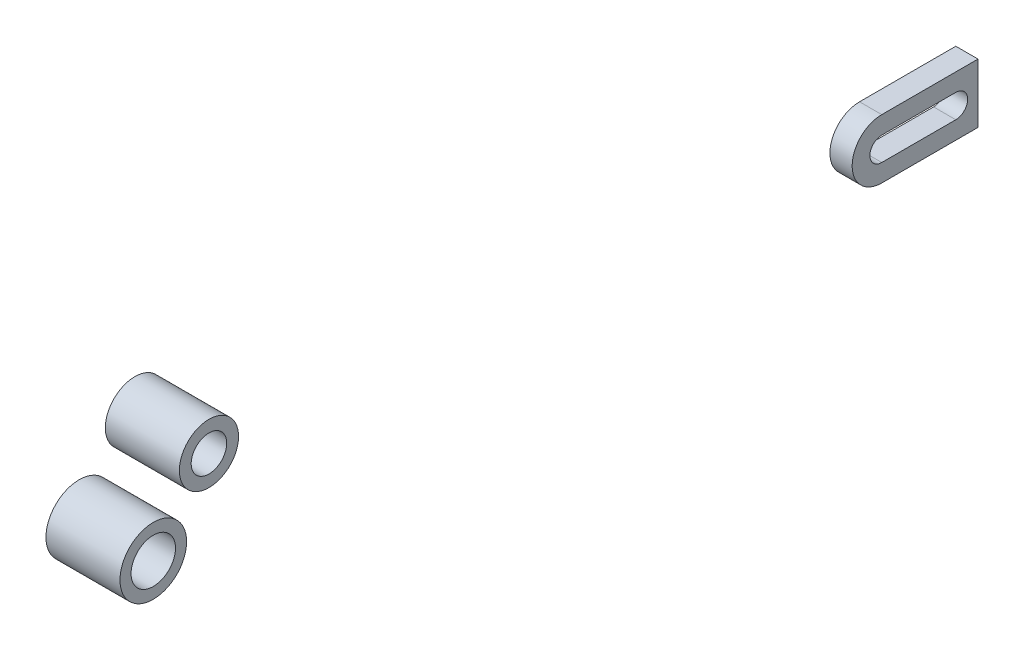
ISO-10303-21;
HEADER;
FILE_DESCRIPTION(('STEP AP214'),'2;1');
FILE_NAME('part.step','',(''),(''),'','','');
FILE_SCHEMA(('AUTOMOTIVE_DESIGN { 1 0 10303 214 1 1 1 1 }'));
ENDSEC;
DATA;
#1=APPLICATION_CONTEXT('core data for automotive mechanical design processes');
#2=APPLICATION_PROTOCOL_DEFINITION('international standard','automotive_design',2000,#1);
#3=PRODUCT_CONTEXT('',#1,'mechanical');
#4=PRODUCT('Part','Part','',(#3));
#5=PRODUCT_RELATED_PRODUCT_CATEGORY('part','',(#4));
#6=PRODUCT_DEFINITION_FORMATION('','',#4);
#7=PRODUCT_DEFINITION_CONTEXT('part definition',#1,'design');
#8=PRODUCT_DEFINITION('design','',#6,#7);
#9=PRODUCT_DEFINITION_SHAPE('','',#8);
#10=(LENGTH_UNIT() NAMED_UNIT(*) SI_UNIT(.MILLI.,.METRE.));
#11=(NAMED_UNIT(*) PLANE_ANGLE_UNIT() SI_UNIT($,.RADIAN.));
#12=(NAMED_UNIT(*) SI_UNIT($,.STERADIAN.) SOLID_ANGLE_UNIT());
#13=UNCERTAINTY_MEASURE_WITH_UNIT(LENGTH_MEASURE(1.E-05),#10,'distance_accuracy_value','');
#14=(GEOMETRIC_REPRESENTATION_CONTEXT(3) GLOBAL_UNCERTAINTY_ASSIGNED_CONTEXT((#13)) GLOBAL_UNIT_ASSIGNED_CONTEXT((#10,
#11,#12)) REPRESENTATION_CONTEXT('',''));
#15=CARTESIAN_POINT('',(0.,0.,0.));
#16=DIRECTION('',(0.,0.,1.));
#17=DIRECTION('',(1.,0.,0.));
#18=AXIS2_PLACEMENT_3D('',#15,#16,#17);
#19=CARTESIAN_POINT('',(139.999999999998,0.,-487.));
#20=DIRECTION('',(1.,0.,0.));
#21=DIRECTION('',(0.,0.,-1.));
#22=AXIS2_PLACEMENT_3D('',#19,#20,#21);
#23=PLANE('',#22);
#24=CARTESIAN_POINT('',(139.999999999998,0.,-487.));
#25=DIRECTION('',(1.,0.,0.));
#26=DIRECTION('',(0.,0.,-1.));
#27=AXIS2_PLACEMENT_3D('',#24,#25,#26);
#28=CIRCLE('',#27,20.0000000000001);
#29=CARTESIAN_POINT('',(139.999999999998,20.0000000000001,-487.));
#30=VERTEX_POINT('',#29);
#31=CARTESIAN_POINT('',(139.999999999998,-20.0000000000001,-487.));
#32=VERTEX_POINT('',#31);
#33=EDGE_CURVE('E146',#30,#32,#28,.T.);
#34=ORIENTED_EDGE('',*,*,#33,.T.);
#35=DIRECTION('',(0.,0.,-1.));
#36=VECTOR('',#35,1.);
#37=CARTESIAN_POINT('',(139.999999999998,-20.0000000000001,-487.));
#38=LINE('',#37,#36);
#39=CARTESIAN_POINT('',(139.999999999998,-20.0000000000001,-552.));
#40=VERTEX_POINT('',#39);
#41=EDGE_CURVE('E149',#32,#40,#38,.T.);
#42=ORIENTED_EDGE('',*,*,#41,.T.);
#43=DIRECTION('',(0.,1.,0.));
#44=VECTOR('',#43,1.);
#45=CARTESIAN_POINT('',(139.999999999998,-20.0000000000001,-552.));
#46=LINE('',#45,#44);
#47=CARTESIAN_POINT('',(139.999999999998,20.,-552.));
#48=VERTEX_POINT('',#47);
#49=EDGE_CURVE('E152',#40,#48,#46,.T.);
#50=ORIENTED_EDGE('',*,*,#49,.T.);
#51=DIRECTION('',(0.,0.,1.));
#52=VECTOR('',#51,1.);
#53=CARTESIAN_POINT('',(139.999999999998,20.0000000000001,-487.));
#54=LINE('',#53,#52);
#55=EDGE_CURVE('E154',#48,#30,#54,.T.);
#56=ORIENTED_EDGE('',*,*,#55,.T.);
#57=EDGE_LOOP('',(#34,#42,#50,#56));
#58=FACE_BOUND('',#57,.T.);
#59=DIRECTION('',(0.,0.,1.));
#60=VECTOR('',#59,1.);
#61=CARTESIAN_POINT('',(139.999999999998,7.99999999999998,-537.));
#62=LINE('',#61,#60);
#63=CARTESIAN_POINT('',(139.999999999998,7.99999999999998,-537.));
#64=VERTEX_POINT('',#63);
#65=CARTESIAN_POINT('',(139.999999999998,7.99999999999998,-487.));
#66=VERTEX_POINT('',#65);
#67=EDGE_CURVE('E118',#64,#66,#62,.T.);
#68=ORIENTED_EDGE('',*,*,#67,.F.);
#69=CARTESIAN_POINT('',(139.999999999998,0.,-537.));
#70=DIRECTION('',(1.,0.,0.));
#71=DIRECTION('',(0.,0.,-1.));
#72=AXIS2_PLACEMENT_3D('',#69,#70,#71);
#73=CIRCLE('',#72,7.99999999999998);
#74=CARTESIAN_POINT('',(139.999999999998,-7.99999999999998,-537.));
#75=VERTEX_POINT('',#74);
#76=EDGE_CURVE('E110',#75,#64,#73,.T.);
#77=ORIENTED_EDGE('',*,*,#76,.F.);
#78=DIRECTION('',(0.,0.,-1.));
#79=VECTOR('',#78,1.);
#80=CARTESIAN_POINT('',(139.999999999998,-7.99999999999998,-537.));
#81=LINE('',#80,#79);
#82=CARTESIAN_POINT('',(139.999999999998,-7.99999999999998,-487.));
#83=VERTEX_POINT('',#82);
#84=EDGE_CURVE('E132',#83,#75,#81,.T.);
#85=ORIENTED_EDGE('',*,*,#84,.F.);
#86=CARTESIAN_POINT('',(139.999999999998,0.,-487.));
#87=DIRECTION('',(1.,0.,0.));
#88=DIRECTION('',(0.,0.,-1.));
#89=AXIS2_PLACEMENT_3D('',#86,#87,#88);
#90=CIRCLE('',#89,7.99999999999998);
#91=EDGE_CURVE('E130',#66,#83,#90,.T.);
#92=ORIENTED_EDGE('',*,*,#91,.F.);
#93=EDGE_LOOP('',(#68,#77,#85,#92));
#94=FACE_BOUND('',#93,.T.);
#95=ADVANCED_FACE('F45',(#58,#94),#23,.T.);
#96=CARTESIAN_POINT('',(124.999999999998,0.,-487.));
#97=DIRECTION('',(1.,0.,0.));
#98=DIRECTION('',(0.,0.,-1.));
#99=AXIS2_PLACEMENT_3D('',#96,#97,#98);
#100=PLANE('',#99);
#101=CARTESIAN_POINT('',(124.999999999998,0.,-487.));
#102=DIRECTION('',(1.,0.,0.));
#103=DIRECTION('',(0.,0.,-1.));
#104=AXIS2_PLACEMENT_3D('',#101,#102,#103);
#105=CIRCLE('',#104,20.0000000000001);
#106=CARTESIAN_POINT('',(124.999999999998,20.0000000000001,-487.));
#107=VERTEX_POINT('',#106);
#108=CARTESIAN_POINT('',(124.999999999998,-20.0000000000001,-487.));
#109=VERTEX_POINT('',#108);
#110=EDGE_CURVE('E126',#107,#109,#105,.T.);
#111=ORIENTED_EDGE('',*,*,#110,.F.);
#112=DIRECTION('',(0.,0.,1.));
#113=VECTOR('',#112,1.);
#114=CARTESIAN_POINT('',(124.999999999998,20.0000000000001,-487.));
#115=LINE('',#114,#113);
#116=CARTESIAN_POINT('',(124.999999999998,20.,-552.));
#117=VERTEX_POINT('',#116);
#118=EDGE_CURVE('E150',#117,#107,#115,.T.);
#119=ORIENTED_EDGE('',*,*,#118,.F.);
#120=DIRECTION('',(0.,1.,0.));
#121=VECTOR('',#120,1.);
#122=CARTESIAN_POINT('',(124.999999999998,-20.0000000000001,-552.));
#123=LINE('',#122,#121);
#124=CARTESIAN_POINT('',(124.999999999998,-20.0000000000001,-552.));
#125=VERTEX_POINT('',#124);
#126=EDGE_CURVE('E161',#125,#117,#123,.T.);
#127=ORIENTED_EDGE('',*,*,#126,.F.);
#128=DIRECTION('',(0.,0.,-1.));
#129=VECTOR('',#128,1.);
#130=CARTESIAN_POINT('',(124.999999999998,-20.0000000000001,-487.));
#131=LINE('',#130,#129);
#132=EDGE_CURVE('E159',#109,#125,#131,.T.);
#133=ORIENTED_EDGE('',*,*,#132,.F.);
#134=EDGE_LOOP('',(#111,#119,#127,#133));
#135=FACE_BOUND('',#134,.T.);
#136=CARTESIAN_POINT('',(124.999999999998,0.,-537.));
#137=DIRECTION('',(1.,0.,0.));
#138=DIRECTION('',(0.,0.,-1.));
#139=AXIS2_PLACEMENT_3D('',#136,#137,#138);
#140=CIRCLE('',#139,7.99999999999998);
#141=CARTESIAN_POINT('',(124.999999999998,-7.99999999999998,-537.));
#142=VERTEX_POINT('',#141);
#143=CARTESIAN_POINT('',(124.999999999998,7.99999999999998,-537.));
#144=VERTEX_POINT('',#143);
#145=EDGE_CURVE('E68',#142,#144,#140,.T.);
#146=ORIENTED_EDGE('',*,*,#145,.T.);
#147=DIRECTION('',(0.,0.,1.));
#148=VECTOR('',#147,1.);
#149=CARTESIAN_POINT('',(124.999999999998,7.99999999999998,-537.));
#150=LINE('',#149,#148);
#151=CARTESIAN_POINT('',(124.999999999998,7.99999999999998,-487.));
#152=VERTEX_POINT('',#151);
#153=EDGE_CURVE('E125',#144,#152,#150,.T.);
#154=ORIENTED_EDGE('',*,*,#153,.T.);
#155=CARTESIAN_POINT('',(124.999999999998,0.,-487.));
#156=DIRECTION('',(1.,0.,0.));
#157=DIRECTION('',(0.,0.,-1.));
#158=AXIS2_PLACEMENT_3D('',#155,#156,#157);
#159=CIRCLE('',#158,7.99999999999998);
#160=CARTESIAN_POINT('',(124.999999999998,-7.99999999999998,-487.));
#161=VERTEX_POINT('',#160);
#162=EDGE_CURVE('E138',#152,#161,#159,.T.);
#163=ORIENTED_EDGE('',*,*,#162,.T.);
#164=DIRECTION('',(0.,0.,-1.));
#165=VECTOR('',#164,1.);
#166=CARTESIAN_POINT('',(124.999999999998,-7.99999999999998,-537.));
#167=LINE('',#166,#165);
#168=EDGE_CURVE('E119',#161,#142,#167,.T.);
#169=ORIENTED_EDGE('',*,*,#168,.T.);
#170=EDGE_LOOP('',(#146,#154,#163,#169));
#171=FACE_BOUND('',#170,.T.);
#172=ADVANCED_FACE('F179',(#135,#171),#100,.F.);
#173=CARTESIAN_POINT('',(139.999999999998,0.,-487.));
#174=DIRECTION('',(-1.,0.,0.));
#175=DIRECTION('',(0.,0.,1.));
#176=AXIS2_PLACEMENT_3D('',#173,#174,#175);
#177=CYLINDRICAL_SURFACE('',#176,20.0000000000001);
#178=ORIENTED_EDGE('',*,*,#110,.T.);
#179=DIRECTION('',(-1.,0.,0.));
#180=VECTOR('',#179,1.);
#181=CARTESIAN_POINT('',(139.999999999998,-20.0000000000001,-487.));
#182=LINE('',#181,#180);
#183=EDGE_CURVE('E12',#32,#109,#182,.T.);
#184=ORIENTED_EDGE('',*,*,#183,.F.);
#185=ORIENTED_EDGE('',*,*,#33,.F.);
#186=DIRECTION('',(-1.,0.,0.));
#187=VECTOR('',#186,1.);
#188=CARTESIAN_POINT('',(139.999999999998,20.0000000000001,-487.));
#189=LINE('',#188,#187);
#190=EDGE_CURVE('E156',#30,#107,#189,.T.);
#191=ORIENTED_EDGE('',*,*,#190,.T.);
#192=EDGE_LOOP('',(#178,#184,#185,#191));
#193=FACE_BOUND('',#192,.T.);
#194=ADVANCED_FACE('F47',(#193),#177,.T.);
#195=CARTESIAN_POINT('',(139.999999999998,-20.0000000000001,-487.));
#196=DIRECTION('',(0.,1.,0.));
#197=DIRECTION('',(0.,0.,1.));
#198=AXIS2_PLACEMENT_3D('',#195,#196,#197);
#199=PLANE('',#198);
#200=ORIENTED_EDGE('',*,*,#132,.T.);
#201=DIRECTION('',(-1.,0.,0.));
#202=VECTOR('',#201,1.);
#203=CARTESIAN_POINT('',(139.999999999998,-20.0000000000001,-552.));
#204=LINE('',#203,#202);
#205=EDGE_CURVE('E53',#40,#125,#204,.T.);
#206=ORIENTED_EDGE('',*,*,#205,.F.);
#207=ORIENTED_EDGE('',*,*,#41,.F.);
#208=ORIENTED_EDGE('',*,*,#183,.T.);
#209=EDGE_LOOP('',(#200,#206,#207,#208));
#210=FACE_BOUND('',#209,.T.);
#211=ADVANCED_FACE('F189',(#210),#199,.F.);
#212=CARTESIAN_POINT('',(139.999999999998,-20.0000000000001,-552.));
#213=DIRECTION('',(0.,0.,1.));
#214=DIRECTION('',(1.,0.,0.));
#215=AXIS2_PLACEMENT_3D('',#212,#213,#214);
#216=PLANE('',#215);
#217=ORIENTED_EDGE('',*,*,#126,.T.);
#218=DIRECTION('',(-1.,0.,0.));
#219=VECTOR('',#218,1.);
#220=CARTESIAN_POINT('',(139.999999999998,20.,-552.));
#221=LINE('',#220,#219);
#222=EDGE_CURVE('E166',#48,#117,#221,.T.);
#223=ORIENTED_EDGE('',*,*,#222,.F.);
#224=ORIENTED_EDGE('',*,*,#49,.F.);
#225=ORIENTED_EDGE('',*,*,#205,.T.);
#226=EDGE_LOOP('',(#217,#223,#224,#225));
#227=FACE_BOUND('',#226,.T.);
#228=ADVANCED_FACE('F173',(#227),#216,.F.);
#229=CARTESIAN_POINT('',(139.999999999998,20.0000000000001,-487.));
#230=DIRECTION('',(0.,-1.,0.));
#231=DIRECTION('',(0.,0.,-1.));
#232=AXIS2_PLACEMENT_3D('',#229,#230,#231);
#233=PLANE('',#232);
#234=ORIENTED_EDGE('',*,*,#118,.T.);
#235=ORIENTED_EDGE('',*,*,#190,.F.);
#236=ORIENTED_EDGE('',*,*,#55,.F.);
#237=ORIENTED_EDGE('',*,*,#222,.T.);
#238=EDGE_LOOP('',(#234,#235,#236,#237));
#239=FACE_BOUND('',#238,.T.);
#240=ADVANCED_FACE('F183',(#239),#233,.F.);
#241=CARTESIAN_POINT('',(139.999999999998,0.,-537.));
#242=DIRECTION('',(-1.,0.,0.));
#243=DIRECTION('',(0.,0.,1.));
#244=AXIS2_PLACEMENT_3D('',#241,#242,#243);
#245=CYLINDRICAL_SURFACE('',#244,7.99999999999998);
#246=ORIENTED_EDGE('',*,*,#145,.F.);
#247=DIRECTION('',(-1.,0.,0.));
#248=VECTOR('',#247,1.);
#249=CARTESIAN_POINT('',(139.999999999998,-7.99999999999998,-537.));
#250=LINE('',#249,#248);
#251=EDGE_CURVE('E114',#75,#142,#250,.T.);
#252=ORIENTED_EDGE('',*,*,#251,.F.);
#253=ORIENTED_EDGE('',*,*,#76,.T.);
#254=DIRECTION('',(-1.,0.,0.));
#255=VECTOR('',#254,1.);
#256=CARTESIAN_POINT('',(139.999999999998,7.99999999999998,-537.));
#257=LINE('',#256,#255);
#258=EDGE_CURVE('E113',#64,#144,#257,.T.);
#259=ORIENTED_EDGE('',*,*,#258,.T.);
#260=EDGE_LOOP('',(#246,#252,#253,#259));
#261=FACE_BOUND('',#260,.T.);
#262=ADVANCED_FACE('F112',(#261),#245,.F.);
#263=CARTESIAN_POINT('',(139.999999999998,7.99999999999998,-537.));
#264=DIRECTION('',(0.,-1.,0.));
#265=DIRECTION('',(0.,0.,-1.));
#266=AXIS2_PLACEMENT_3D('',#263,#264,#265);
#267=PLANE('',#266);
#268=ORIENTED_EDGE('',*,*,#153,.F.);
#269=ORIENTED_EDGE('',*,*,#258,.F.);
#270=ORIENTED_EDGE('',*,*,#67,.T.);
#271=DIRECTION('',(-1.,0.,0.));
#272=VECTOR('',#271,1.);
#273=CARTESIAN_POINT('',(139.999999999998,7.99999999999998,-487.));
#274=LINE('',#273,#272);
#275=EDGE_CURVE('E127',#66,#152,#274,.T.);
#276=ORIENTED_EDGE('',*,*,#275,.T.);
#277=EDGE_LOOP('',(#268,#269,#270,#276));
#278=FACE_BOUND('',#277,.T.);
#279=ADVANCED_FACE('F122',(#278),#267,.T.);
#280=CARTESIAN_POINT('',(139.999999999998,0.,-487.));
#281=DIRECTION('',(-1.,0.,0.));
#282=DIRECTION('',(0.,0.,1.));
#283=AXIS2_PLACEMENT_3D('',#280,#281,#282);
#284=CYLINDRICAL_SURFACE('',#283,7.99999999999998);
#285=ORIENTED_EDGE('',*,*,#162,.F.);
#286=ORIENTED_EDGE('',*,*,#275,.F.);
#287=ORIENTED_EDGE('',*,*,#91,.T.);
#288=DIRECTION('',(-1.,0.,0.));
#289=VECTOR('',#288,1.);
#290=CARTESIAN_POINT('',(139.999999999998,-7.99999999999998,-487.));
#291=LINE('',#290,#289);
#292=EDGE_CURVE('E60',#83,#161,#291,.T.);
#293=ORIENTED_EDGE('',*,*,#292,.T.);
#294=EDGE_LOOP('',(#285,#286,#287,#293));
#295=FACE_BOUND('',#294,.T.);
#296=ADVANCED_FACE('F212',(#295),#284,.F.);
#297=CARTESIAN_POINT('',(139.999999999998,-7.99999999999998,-537.));
#298=DIRECTION('',(0.,1.,0.));
#299=DIRECTION('',(0.,0.,1.));
#300=AXIS2_PLACEMENT_3D('',#297,#298,#299);
#301=PLANE('',#300);
#302=ORIENTED_EDGE('',*,*,#168,.F.);
#303=ORIENTED_EDGE('',*,*,#292,.F.);
#304=ORIENTED_EDGE('',*,*,#84,.T.);
#305=ORIENTED_EDGE('',*,*,#251,.T.);
#306=EDGE_LOOP('',(#302,#303,#304,#305));
#307=FACE_BOUND('',#306,.T.);
#308=ADVANCED_FACE('F216',(#307),#301,.T.);
#309=CLOSED_SHELL('',(#95,#172,#194,#211,#228,#240,#262,#279,#296,#308));
#310=MANIFOLD_SOLID_BREP('B2',#309);
#311=CARTESIAN_POINT('',(25.,-66.,-147.6));
#312=DIRECTION('',(1.,0.,0.));
#313=DIRECTION('',(0.,0.,-1.));
#314=AXIS2_PLACEMENT_3D('',#311,#312,#313);
#315=PLANE('',#314);
#316=CARTESIAN_POINT('',(25.,-66.,-147.6));
#317=DIRECTION('',(1.,0.,0.));
#318=DIRECTION('',(0.,0.,-1.));
#319=AXIS2_PLACEMENT_3D('',#316,#317,#318);
#320=CIRCLE('',#319,20.);
#321=CARTESIAN_POINT('',(25.,-66.,-167.6));
#322=VERTEX_POINT('',#321);
#323=EDGE_CURVE('E44',#322,#322,#320,.T.);
#324=ORIENTED_EDGE('',*,*,#323,.T.);
#325=EDGE_LOOP('',(#324));
#326=FACE_BOUND('',#325,.T.);
#327=CARTESIAN_POINT('',(25.,-66.,-147.6));
#328=DIRECTION('',(1.,0.,0.));
#329=DIRECTION('',(0.,0.,-1.));
#330=AXIS2_PLACEMENT_3D('',#327,#328,#329);
#331=CIRCLE('',#330,12.);
#332=CARTESIAN_POINT('',(25.,-66.,-159.6));
#333=VERTEX_POINT('',#332);
#334=EDGE_CURVE('E292',#333,#333,#331,.T.);
#335=ORIENTED_EDGE('',*,*,#334,.F.);
#336=EDGE_LOOP('',(#335));
#337=FACE_BOUND('',#336,.T.);
#338=ADVANCED_FACE('F281',(#326,#337),#315,.T.);
#339=CARTESIAN_POINT('',(-25.,-66.,-147.6));
#340=DIRECTION('',(1.,0.,0.));
#341=DIRECTION('',(0.,0.,-1.));
#342=AXIS2_PLACEMENT_3D('',#339,#340,#341);
#343=PLANE('',#342);
#344=CARTESIAN_POINT('',(-25.,-66.,-147.6));
#345=DIRECTION('',(1.,0.,0.));
#346=DIRECTION('',(0.,0.,-1.));
#347=AXIS2_PLACEMENT_3D('',#344,#345,#346);
#348=CIRCLE('',#347,20.);
#349=CARTESIAN_POINT('',(-25.,-66.,-167.6));
#350=VERTEX_POINT('',#349);
#351=EDGE_CURVE('E285',#350,#350,#348,.T.);
#352=ORIENTED_EDGE('',*,*,#351,.F.);
#353=EDGE_LOOP('',(#352));
#354=FACE_BOUND('',#353,.T.);
#355=CARTESIAN_POINT('',(-25.,-66.,-147.6));
#356=DIRECTION('',(1.,0.,0.));
#357=DIRECTION('',(0.,0.,-1.));
#358=AXIS2_PLACEMENT_3D('',#355,#356,#357);
#359=CIRCLE('',#358,12.);
#360=CARTESIAN_POINT('',(-25.,-66.,-159.6));
#361=VERTEX_POINT('',#360);
#362=EDGE_CURVE('E294',#361,#361,#359,.T.);
#363=ORIENTED_EDGE('',*,*,#362,.T.);
#364=EDGE_LOOP('',(#363));
#365=FACE_BOUND('',#364,.T.);
#366=ADVANCED_FACE('F304',(#354,#365),#343,.F.);
#367=CARTESIAN_POINT('',(25.,-66.,-147.6));
#368=DIRECTION('',(-1.,0.,0.));
#369=DIRECTION('',(0.,0.,1.));
#370=AXIS2_PLACEMENT_3D('',#367,#368,#369);
#371=CYLINDRICAL_SURFACE('',#370,20.);
#372=ORIENTED_EDGE('',*,*,#323,.F.);
#373=EDGE_LOOP('',(#372));
#374=FACE_BOUND('',#373,.T.);
#375=ORIENTED_EDGE('',*,*,#351,.T.);
#376=EDGE_LOOP('',(#375));
#377=FACE_BOUND('',#376,.T.);
#378=ADVANCED_FACE('F283',(#374,#377),#371,.T.);
#379=CARTESIAN_POINT('',(25.,-66.,-147.6));
#380=DIRECTION('',(-1.,0.,0.));
#381=DIRECTION('',(0.,0.,1.));
#382=AXIS2_PLACEMENT_3D('',#379,#380,#381);
#383=CYLINDRICAL_SURFACE('',#382,12.);
#384=ORIENTED_EDGE('',*,*,#334,.T.);
#385=EDGE_LOOP('',(#384));
#386=FACE_BOUND('',#385,.T.);
#387=ORIENTED_EDGE('',*,*,#362,.F.);
#388=EDGE_LOOP('',(#387));
#389=FACE_BOUND('',#388,.T.);
#390=ADVANCED_FACE('F300',(#386,#389),#383,.F.);
#391=CLOSED_SHELL('',(#338,#366,#378,#390));
#392=MANIFOLD_SOLID_BREP('B6',#391);
#393=CARTESIAN_POINT('',(85.,0.,-3.79866681173939E-13));
#394=DIRECTION('',(1.,0.,0.));
#395=DIRECTION('',(0.,0.,-1.));
#396=AXIS2_PLACEMENT_3D('',#393,#394,#395);
#397=CYLINDRICAL_SURFACE('',#396,22.5);
#398=CARTESIAN_POINT('',(85.,0.,-3.79866681173939E-13));
#399=DIRECTION('',(1.,0.,0.));
#400=DIRECTION('',(0.,0.,-1.));
#401=AXIS2_PLACEMENT_3D('',#398,#399,#400);
#402=CIRCLE('',#401,22.5);
#403=CARTESIAN_POINT('',(85.,0.,-22.5000000000004));
#404=VERTEX_POINT('',#403);
#405=EDGE_CURVE('E280',#404,#404,#402,.T.);
#406=ORIENTED_EDGE('',*,*,#405,.T.);
#407=EDGE_LOOP('',(#406));
#408=FACE_BOUND('',#407,.T.);
#409=CARTESIAN_POINT('',(135.,0.,-3.79866681173939E-13));
#410=DIRECTION('',(1.,0.,0.));
#411=DIRECTION('',(0.,0.,-1.));
#412=AXIS2_PLACEMENT_3D('',#409,#410,#411);
#413=CIRCLE('',#412,22.5);
#414=CARTESIAN_POINT('',(135.,0.,-22.5000000000004));
#415=VERTEX_POINT('',#414);
#416=EDGE_CURVE('E345',#415,#415,#413,.T.);
#417=ORIENTED_EDGE('',*,*,#416,.F.);
#418=EDGE_LOOP('',(#417));
#419=FACE_BOUND('',#418,.T.);
#420=ADVANCED_FACE('F342',(#408,#419),#397,.T.);
#421=CARTESIAN_POINT('',(85.,0.,-3.79866681173939E-13));
#422=DIRECTION('',(1.,0.,0.));
#423=DIRECTION('',(0.,0.,-1.));
#424=AXIS2_PLACEMENT_3D('',#421,#422,#423);
#425=PLANE('',#424);
#426=CARTESIAN_POINT('',(85.,0.,-3.79866681173939E-13));
#427=DIRECTION('',(1.,0.,0.));
#428=DIRECTION('',(0.,0.,-1.));
#429=AXIS2_PLACEMENT_3D('',#426,#427,#428);
#430=CIRCLE('',#429,15.);
#431=CARTESIAN_POINT('',(85.,0.,-15.0000000000004));
#432=VERTEX_POINT('',#431);
#433=EDGE_CURVE('E352',#432,#432,#430,.T.);
#434=ORIENTED_EDGE('',*,*,#433,.T.);
#435=EDGE_LOOP('',(#434));
#436=FACE_BOUND('',#435,.T.);
#437=ORIENTED_EDGE('',*,*,#405,.F.);
#438=EDGE_LOOP('',(#437));
#439=FACE_BOUND('',#438,.T.);
#440=ADVANCED_FACE('F360',(#436,#439),#425,.F.);
#441=CARTESIAN_POINT('',(135.,0.,-3.79866681173939E-13));
#442=DIRECTION('',(1.,0.,0.));
#443=DIRECTION('',(0.,0.,-1.));
#444=AXIS2_PLACEMENT_3D('',#441,#442,#443);
#445=PLANE('',#444);
#446=CARTESIAN_POINT('',(135.,0.,-3.79866681173939E-13));
#447=DIRECTION('',(1.,0.,0.));
#448=DIRECTION('',(0.,0.,-1.));
#449=AXIS2_PLACEMENT_3D('',#446,#447,#448);
#450=CIRCLE('',#449,15.);
#451=CARTESIAN_POINT('',(135.,0.,-15.0000000000004));
#452=VERTEX_POINT('',#451);
#453=EDGE_CURVE('E354',#452,#452,#450,.T.);
#454=ORIENTED_EDGE('',*,*,#453,.F.);
#455=EDGE_LOOP('',(#454));
#456=FACE_BOUND('',#455,.T.);
#457=ORIENTED_EDGE('',*,*,#416,.T.);
#458=EDGE_LOOP('',(#457));
#459=FACE_BOUND('',#458,.T.);
#460=ADVANCED_FACE('F366',(#456,#459),#445,.T.);
#461=CARTESIAN_POINT('',(85.,0.,-3.79866681173939E-13));
#462=DIRECTION('',(1.,0.,0.));
#463=DIRECTION('',(0.,0.,-1.));
#464=AXIS2_PLACEMENT_3D('',#461,#462,#463);
#465=CYLINDRICAL_SURFACE('',#464,15.);
#466=ORIENTED_EDGE('',*,*,#433,.F.);
#467=EDGE_LOOP('',(#466));
#468=FACE_BOUND('',#467,.T.);
#469=ORIENTED_EDGE('',*,*,#453,.T.);
#470=EDGE_LOOP('',(#469));
#471=FACE_BOUND('',#470,.T.);
#472=ADVANCED_FACE('F363',(#468,#471),#465,.F.);
#473=CLOSED_SHELL('',(#420,#440,#460,#472));
#474=MANIFOLD_SOLID_BREP('B39',#473);
#475=ADVANCED_BREP_SHAPE_REPRESENTATION('',(#18,#310,#392,#474),#14);
#476=SHAPE_DEFINITION_REPRESENTATION(#9,#475);
ENDSEC;
END-ISO-10303-21;
